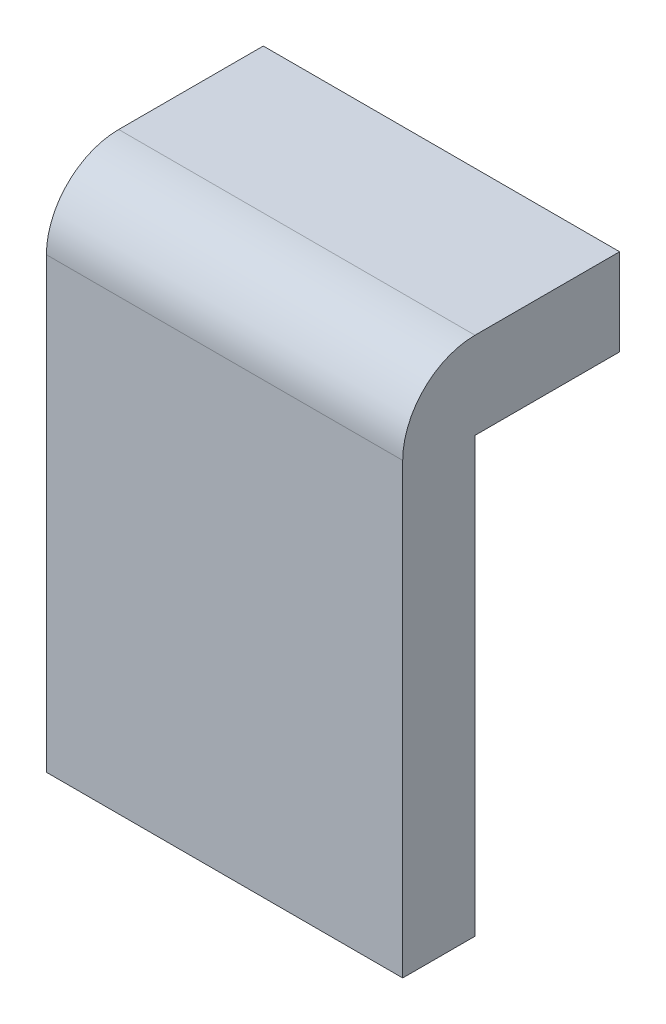
ISO-10303-21;
HEADER;
FILE_DESCRIPTION(('STEP AP214'),'2;1');
FILE_NAME('part.step','',(''),(''),'','','');
FILE_SCHEMA(('AUTOMOTIVE_DESIGN { 1 0 10303 214 1 1 1 1 }'));
ENDSEC;
DATA;
#1=APPLICATION_CONTEXT('core data for automotive mechanical design processes');
#2=APPLICATION_PROTOCOL_DEFINITION('international standard','automotive_design',2000,#1);
#3=PRODUCT_CONTEXT('',#1,'mechanical');
#4=PRODUCT('Part','Part','',(#3));
#5=PRODUCT_RELATED_PRODUCT_CATEGORY('part','',(#4));
#6=PRODUCT_DEFINITION_FORMATION('','',#4);
#7=PRODUCT_DEFINITION_CONTEXT('part definition',#1,'design');
#8=PRODUCT_DEFINITION('design','',#6,#7);
#9=PRODUCT_DEFINITION_SHAPE('','',#8);
#10=(LENGTH_UNIT() NAMED_UNIT(*) SI_UNIT(.MILLI.,.METRE.));
#11=(NAMED_UNIT(*) PLANE_ANGLE_UNIT() SI_UNIT($,.RADIAN.));
#12=(NAMED_UNIT(*) SI_UNIT($,.STERADIAN.) SOLID_ANGLE_UNIT());
#13=UNCERTAINTY_MEASURE_WITH_UNIT(LENGTH_MEASURE(1.E-05),#10,'distance_accuracy_value','');
#14=(GEOMETRIC_REPRESENTATION_CONTEXT(3) GLOBAL_UNCERTAINTY_ASSIGNED_CONTEXT((#13)) GLOBAL_UNIT_ASSIGNED_CONTEXT((#10,
#11,#12)) REPRESENTATION_CONTEXT('',''));
#15=CARTESIAN_POINT('',(0.,0.,0.));
#16=DIRECTION('',(0.,0.,1.));
#17=DIRECTION('',(1.,0.,0.));
#18=AXIS2_PLACEMENT_3D('',#15,#16,#17);
#19=CARTESIAN_POINT('',(-8.34906661620967,8.30000000000001,12.2546737770755));
#20=DIRECTION('',(0.,0.,1.));
#21=DIRECTION('',(0.,-1.,0.));
#22=AXIS2_PLACEMENT_3D('',#19,#20,#21);
#23=PLANE('',#22);
#24=DIRECTION('',(1.,0.,0.));
#25=VECTOR('',#24,1.);
#26=CARTESIAN_POINT('',(-15.8147962412963,6.80000000000003,12.2546737770755));
#27=LINE('',#26,#25);
#28=CARTESIAN_POINT('',(16.6909354919998,6.80000000000003,12.2546737770755));
#29=VERTEX_POINT('',#28);
#30=CARTESIAN_POINT('',(17.9230862484405,6.80000000000003,12.2546737770755));
#31=VERTEX_POINT('',#30);
#32=EDGE_CURVE('E113',#29,#31,#27,.T.);
#33=ORIENTED_EDGE('',*,*,#32,.F.);
#34=DIRECTION('',(0.,1.,0.));
#35=VECTOR('',#34,1.);
#36=CARTESIAN_POINT('',(16.6909354919998,5.35753839337147,12.2546737770755));
#37=LINE('',#36,#35);
#38=CARTESIAN_POINT('',(16.6909354919998,8.30000000000001,12.2546737770755));
#39=VERTEX_POINT('',#38);
#40=EDGE_CURVE('E148',#39,#29,#37,.F.);
#41=ORIENTED_EDGE('',*,*,#40,.F.);
#42=DIRECTION('',(1.,0.,0.));
#43=VECTOR('',#42,1.);
#44=CARTESIAN_POINT('',(-8.34906661620967,8.30000000000001,12.2546737770755));
#45=LINE('',#44,#43);
#46=CARTESIAN_POINT('',(17.9230862484405,8.30000000000001,12.2546737770755));
#47=VERTEX_POINT('',#46);
#48=EDGE_CURVE('E133',#39,#47,#45,.T.);
#49=ORIENTED_EDGE('',*,*,#48,.T.);
#50=DIRECTION('',(0.,1.,0.));
#51=VECTOR('',#50,1.);
#52=CARTESIAN_POINT('',(17.9230862484405,5.35753839337147,12.2546737770755));
#53=LINE('',#52,#51);
#54=EDGE_CURVE('E105',#31,#47,#53,.T.);
#55=ORIENTED_EDGE('',*,*,#54,.F.);
#56=EDGE_LOOP('',(#33,#41,#49,#55));
#57=FACE_BOUND('',#56,.T.);
#58=ADVANCED_FACE('F17',(#57),#23,.F.);
#59=CARTESIAN_POINT('',(-8.34906661620967,8.30000000000001,11.7546737770755));
#60=DIRECTION('',(0.,1.,0.));
#61=DIRECTION('',(0.,0.,1.));
#62=AXIS2_PLACEMENT_3D('',#59,#60,#61);
#63=PLANE('',#62);
#64=ORIENTED_EDGE('',*,*,#48,.F.);
#65=DIRECTION('',(0.,0.,1.));
#66=VECTOR('',#65,1.);
#67=CARTESIAN_POINT('',(16.6909354919998,8.30000000000001,12.5046737770755));
#68=LINE('',#67,#66);
#69=CARTESIAN_POINT('',(16.6909354919998,8.30000000000001,11.7546737770755));
#70=VERTEX_POINT('',#69);
#71=EDGE_CURVE('E153',#70,#39,#68,.T.);
#72=ORIENTED_EDGE('',*,*,#71,.F.);
#73=DIRECTION('',(1.,0.,0.));
#74=VECTOR('',#73,1.);
#75=CARTESIAN_POINT('',(16.6909354919998,8.30000000000001,11.7546737770755));
#76=LINE('',#75,#74);
#77=CARTESIAN_POINT('',(17.9230862484405,8.30000000000001,11.7546737770755));
#78=VERTEX_POINT('',#77);
#79=EDGE_CURVE('E124',#78,#70,#76,.F.);
#80=ORIENTED_EDGE('',*,*,#79,.F.);
#81=DIRECTION('',(0.,0.,-1.));
#82=VECTOR('',#81,1.);
#83=CARTESIAN_POINT('',(17.9230862484405,8.30000000000001,12.5046737770755));
#84=LINE('',#83,#82);
#85=EDGE_CURVE('E129',#47,#78,#84,.T.);
#86=ORIENTED_EDGE('',*,*,#85,.F.);
#87=EDGE_LOOP('',(#64,#72,#80,#86));
#88=FACE_BOUND('',#87,.T.);
#89=ADVANCED_FACE('F175',(#88),#63,.F.);
#90=CARTESIAN_POINT('',(16.6909354919998,5.35753839337146,11.7546737770755));
#91=DIRECTION('',(0.,0.,-1.));
#92=DIRECTION('',(0.,1.,0.));
#93=AXIS2_PLACEMENT_3D('',#90,#91,#92);
#94=PLANE('',#93);
#95=ORIENTED_EDGE('',*,*,#79,.T.);
#96=DIRECTION('',(0.,1.,0.));
#97=VECTOR('',#96,1.);
#98=CARTESIAN_POINT('',(16.6909354919998,5.35753839337147,11.7546737770755));
#99=LINE('',#98,#97);
#100=CARTESIAN_POINT('',(16.6909354919998,8.6,11.7546737770755));
#101=VERTEX_POINT('',#100);
#102=EDGE_CURVE('E119',#101,#70,#99,.F.);
#103=ORIENTED_EDGE('',*,*,#102,.F.);
#104=DIRECTION('',(1.,0.,0.));
#105=VECTOR('',#104,1.);
#106=CARTESIAN_POINT('',(-8.34906661620967,8.6,11.7546737770755));
#107=LINE('',#106,#105);
#108=CARTESIAN_POINT('',(17.9230862484405,8.6,11.7546737770755));
#109=VERTEX_POINT('',#108);
#110=EDGE_CURVE('E122',#101,#109,#107,.T.);
#111=ORIENTED_EDGE('',*,*,#110,.T.);
#112=DIRECTION('',(0.,1.,0.));
#113=VECTOR('',#112,1.);
#114=CARTESIAN_POINT('',(17.9230862484405,5.35753839337147,11.7546737770755));
#115=LINE('',#114,#113);
#116=EDGE_CURVE('E97',#78,#109,#115,.T.);
#117=ORIENTED_EDGE('',*,*,#116,.F.);
#118=EDGE_LOOP('',(#95,#103,#111,#117));
#119=FACE_BOUND('',#118,.T.);
#120=ADVANCED_FACE('F172',(#119),#94,.T.);
#121=CARTESIAN_POINT('',(-8.34906661620967,8.6,11.7546737770755));
#122=DIRECTION('',(0.,-1.,0.));
#123=DIRECTION('',(0.,0.,-1.));
#124=AXIS2_PLACEMENT_3D('',#121,#122,#123);
#125=PLANE('',#124);
#126=ORIENTED_EDGE('',*,*,#110,.F.);
#127=DIRECTION('',(0.,0.,1.));
#128=VECTOR('',#127,1.);
#129=CARTESIAN_POINT('',(16.6909354919998,8.6,12.5046737770755));
#130=LINE('',#129,#128);
#131=CARTESIAN_POINT('',(16.6909354919998,8.6,12.2546737770755));
#132=VERTEX_POINT('',#131);
#133=EDGE_CURVE('E83',#132,#101,#130,.F.);
#134=ORIENTED_EDGE('',*,*,#133,.F.);
#135=DIRECTION('',(1.,0.,0.));
#136=VECTOR('',#135,1.);
#137=CARTESIAN_POINT('',(-8.34906661620967,8.6,12.2546737770755));
#138=LINE('',#137,#136);
#139=CARTESIAN_POINT('',(17.9230862484405,8.6,12.2546737770755));
#140=VERTEX_POINT('',#139);
#141=EDGE_CURVE('E79',#140,#132,#138,.F.);
#142=ORIENTED_EDGE('',*,*,#141,.F.);
#143=DIRECTION('',(0.,0.,-1.));
#144=VECTOR('',#143,1.);
#145=CARTESIAN_POINT('',(17.9230862484405,8.6,12.5046737770755));
#146=LINE('',#145,#144);
#147=EDGE_CURVE('E94',#109,#140,#146,.F.);
#148=ORIENTED_EDGE('',*,*,#147,.F.);
#149=EDGE_LOOP('',(#126,#134,#142,#148));
#150=FACE_BOUND('',#149,.T.);
#151=ADVANCED_FACE('F168',(#150),#125,.F.);
#152=CARTESIAN_POINT('',(-8.34906661620967,8.35,12.2546737770755));
#153=DIRECTION('',(1.,0.,0.));
#154=DIRECTION('',(0.,0.,-1.));
#155=AXIS2_PLACEMENT_3D('',#152,#153,#154);
#156=CYLINDRICAL_SURFACE('',#155,0.249999999999995);
#157=CARTESIAN_POINT('',(16.6909354919997,8.35,12.2546737770755));
#158=DIRECTION('',(1.,0.,0.));
#159=DIRECTION('',(0.,0.,-1.));
#160=AXIS2_PLACEMENT_3D('',#157,#158,#159);
#161=CIRCLE('',#160,0.249999999999995);
#162=CARTESIAN_POINT('',(16.6909354919997,8.35,12.5046737770755));
#163=VERTEX_POINT('',#162);
#164=EDGE_CURVE('E20',#163,#132,#161,.F.);
#165=ORIENTED_EDGE('',*,*,#164,.F.);
#166=DIRECTION('',(1.,0.,0.));
#167=VECTOR('',#166,1.);
#168=CARTESIAN_POINT('',(16.6909354919998,8.35,12.5046737770755));
#169=LINE('',#168,#167);
#170=CARTESIAN_POINT('',(17.9230862484405,8.35,12.5046737770755));
#171=VERTEX_POINT('',#170);
#172=EDGE_CURVE('E77',#171,#163,#169,.F.);
#173=ORIENTED_EDGE('',*,*,#172,.F.);
#174=CARTESIAN_POINT('',(17.9230862484405,8.35,12.2546737770755));
#175=DIRECTION('',(1.,0.,0.));
#176=DIRECTION('',(0.,0.,-1.));
#177=AXIS2_PLACEMENT_3D('',#174,#175,#176);
#178=CIRCLE('',#177,0.249999999999995);
#179=EDGE_CURVE('E106',#140,#171,#178,.T.);
#180=ORIENTED_EDGE('',*,*,#179,.F.);
#181=ORIENTED_EDGE('',*,*,#141,.T.);
#182=EDGE_LOOP('',(#165,#173,#180,#181));
#183=FACE_BOUND('',#182,.T.);
#184=ADVANCED_FACE('F74',(#183),#156,.T.);
#185=CARTESIAN_POINT('',(16.6909354919998,5.35753839337147,12.5046737770755));
#186=DIRECTION('',(-1.,0.,0.));
#187=DIRECTION('',(0.,0.,1.));
#188=AXIS2_PLACEMENT_3D('',#185,#186,#187);
#189=PLANE('',#188);
#190=DIRECTION('',(0.,0.,-1.));
#191=VECTOR('',#190,1.);
#192=CARTESIAN_POINT('',(16.6909354919998,6.80000000000003,12.5046737770755));
#193=LINE('',#192,#191);
#194=CARTESIAN_POINT('',(16.6909354919998,6.80000000000003,12.5046737770755));
#195=VERTEX_POINT('',#194);
#196=EDGE_CURVE('E89',#195,#29,#193,.T.);
#197=ORIENTED_EDGE('',*,*,#196,.F.);
#198=DIRECTION('',(0.,-1.,0.));
#199=VECTOR('',#198,1.);
#200=CARTESIAN_POINT('',(16.6909354919997,5.35753839337147,12.5046737770755));
#201=LINE('',#200,#199);
#202=EDGE_CURVE('E85',#163,#195,#201,.T.);
#203=ORIENTED_EDGE('',*,*,#202,.F.);
#204=ORIENTED_EDGE('',*,*,#164,.T.);
#205=ORIENTED_EDGE('',*,*,#133,.T.);
#206=ORIENTED_EDGE('',*,*,#102,.T.);
#207=ORIENTED_EDGE('',*,*,#71,.T.);
#208=ORIENTED_EDGE('',*,*,#40,.T.);
#209=EDGE_LOOP('',(#197,#203,#204,#205,#206,#207,#208));
#210=FACE_BOUND('',#209,.T.);
#211=ADVANCED_FACE('F86',(#210),#189,.T.);
#212=CARTESIAN_POINT('',(-15.8147962412963,6.80000000000003,12.5046737770755));
#213=DIRECTION('',(0.,-1.,0.));
#214=DIRECTION('',(0.,0.,-1.));
#215=AXIS2_PLACEMENT_3D('',#212,#213,#214);
#216=PLANE('',#215);
#217=DIRECTION('',(1.,0.,0.));
#218=VECTOR('',#217,1.);
#219=CARTESIAN_POINT('',(16.6909354919998,6.80000000000003,12.5046737770755));
#220=LINE('',#219,#218);
#221=CARTESIAN_POINT('',(17.9230862484405,6.80000000000003,12.5046737770755));
#222=VERTEX_POINT('',#221);
#223=EDGE_CURVE('E26',#195,#222,#220,.T.);
#224=ORIENTED_EDGE('',*,*,#223,.F.);
#225=ORIENTED_EDGE('',*,*,#196,.T.);
#226=ORIENTED_EDGE('',*,*,#32,.T.);
#227=DIRECTION('',(0.,0.,-1.));
#228=VECTOR('',#227,1.);
#229=CARTESIAN_POINT('',(17.9230862484405,6.80000000000003,12.5046737770755));
#230=LINE('',#229,#228);
#231=EDGE_CURVE('E35',#222,#31,#230,.T.);
#232=ORIENTED_EDGE('',*,*,#231,.F.);
#233=EDGE_LOOP('',(#224,#225,#226,#232));
#234=FACE_BOUND('',#233,.T.);
#235=ADVANCED_FACE('F179',(#234),#216,.T.);
#236=CARTESIAN_POINT('',(17.9230862484405,5.35753839337147,12.5046737770755));
#237=DIRECTION('',(1.,0.,0.));
#238=DIRECTION('',(0.,0.,-1.));
#239=AXIS2_PLACEMENT_3D('',#236,#237,#238);
#240=PLANE('',#239);
#241=ORIENTED_EDGE('',*,*,#116,.T.);
#242=ORIENTED_EDGE('',*,*,#147,.T.);
#243=ORIENTED_EDGE('',*,*,#179,.T.);
#244=DIRECTION('',(0.,-1.,0.));
#245=VECTOR('',#244,1.);
#246=CARTESIAN_POINT('',(17.9230862484405,5.35753839337147,12.5046737770755));
#247=LINE('',#246,#245);
#248=EDGE_CURVE('E11',#222,#171,#247,.F.);
#249=ORIENTED_EDGE('',*,*,#248,.F.);
#250=ORIENTED_EDGE('',*,*,#231,.T.);
#251=ORIENTED_EDGE('',*,*,#54,.T.);
#252=ORIENTED_EDGE('',*,*,#85,.T.);
#253=EDGE_LOOP('',(#241,#242,#243,#249,#250,#251,#252));
#254=FACE_BOUND('',#253,.T.);
#255=ADVANCED_FACE('F164',(#254),#240,.T.);
#256=CARTESIAN_POINT('',(16.6909354919998,5.35753839337147,12.5046737770755));
#257=DIRECTION('',(0.,0.,1.));
#258=DIRECTION('',(0.,-1.,0.));
#259=AXIS2_PLACEMENT_3D('',#256,#257,#258);
#260=PLANE('',#259);
#261=ORIENTED_EDGE('',*,*,#223,.T.);
#262=ORIENTED_EDGE('',*,*,#248,.T.);
#263=ORIENTED_EDGE('',*,*,#172,.T.);
#264=ORIENTED_EDGE('',*,*,#202,.T.);
#265=EDGE_LOOP('',(#261,#262,#263,#264));
#266=FACE_BOUND('',#265,.T.);
#267=ADVANCED_FACE('F93',(#266),#260,.T.);
#268=CLOSED_SHELL('',(#58,#89,#120,#151,#184,#211,#235,#255,#267));
#269=MANIFOLD_SOLID_BREP('B1',#268);
#270=ADVANCED_BREP_SHAPE_REPRESENTATION('',(#18,#269),#14);
#271=SHAPE_DEFINITION_REPRESENTATION(#9,#270);
ENDSEC;
END-ISO-10303-21;
